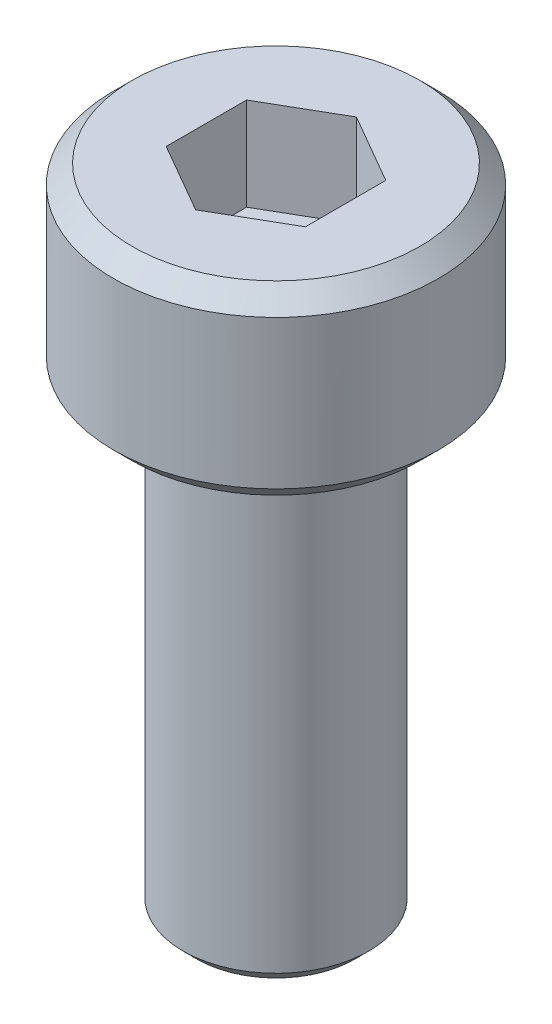
ISO-10303-21;
HEADER;
FILE_DESCRIPTION(('STEP AP214'),'2;1');
FILE_NAME('part.step','',(''),(''),'','','');
FILE_SCHEMA(('AUTOMOTIVE_DESIGN { 1 0 10303 214 1 1 1 1 }'));
ENDSEC;
DATA;
#1=APPLICATION_CONTEXT('core data for automotive mechanical design processes');
#2=APPLICATION_PROTOCOL_DEFINITION('international standard','automotive_design',2000,#1);
#3=PRODUCT_CONTEXT('',#1,'mechanical');
#4=PRODUCT('Part','Part','',(#3));
#5=PRODUCT_RELATED_PRODUCT_CATEGORY('part','',(#4));
#6=PRODUCT_DEFINITION_FORMATION('','',#4);
#7=PRODUCT_DEFINITION_CONTEXT('part definition',#1,'design');
#8=PRODUCT_DEFINITION('design','',#6,#7);
#9=PRODUCT_DEFINITION_SHAPE('','',#8);
#10=(LENGTH_UNIT() NAMED_UNIT(*) SI_UNIT(.MILLI.,.METRE.));
#11=(NAMED_UNIT(*) PLANE_ANGLE_UNIT() SI_UNIT($,.RADIAN.));
#12=(NAMED_UNIT(*) SI_UNIT($,.STERADIAN.) SOLID_ANGLE_UNIT());
#13=UNCERTAINTY_MEASURE_WITH_UNIT(LENGTH_MEASURE(1.E-05),#10,'distance_accuracy_value','');
#14=(GEOMETRIC_REPRESENTATION_CONTEXT(3) GLOBAL_UNCERTAINTY_ASSIGNED_CONTEXT((#13)) GLOBAL_UNIT_ASSIGNED_CONTEXT((#10,
#11,#12)) REPRESENTATION_CONTEXT('',''));
#15=CARTESIAN_POINT('',(0.,0.,0.));
#16=DIRECTION('',(0.,0.,1.));
#17=DIRECTION('',(1.,0.,0.));
#18=AXIS2_PLACEMENT_3D('',#15,#16,#17);
#19=CARTESIAN_POINT('',(0.,2.,-1.73205080756888));
#20=DIRECTION('',(-0.500000000000001,0.,-0.866025403784438));
#21=DIRECTION('',(-0.866025403784438,0.,0.500000000000001));
#22=AXIS2_PLACEMENT_3D('',#19,#20,#21);
#23=PLANE('',#22);
#24=DIRECTION('',(0.,1.,0.));
#25=VECTOR('',#24,1.);
#26=CARTESIAN_POINT('',(-1.5,2.,-0.866025403784438));
#27=LINE('',#26,#25);
#28=CARTESIAN_POINT('',(-1.5,4.,-0.866025403784437));
#29=VERTEX_POINT('',#28);
#30=CARTESIAN_POINT('',(-1.5,2.,-0.866025403784437));
#31=VERTEX_POINT('',#30);
#32=EDGE_CURVE('E82',#29,#31,#27,.F.);
#33=ORIENTED_EDGE('',*,*,#32,.T.);
#34=DIRECTION('',(-0.866025403784438,0.,0.500000000000001));
#35=VECTOR('',#34,1.);
#36=CARTESIAN_POINT('',(0.,2.,-1.73205080756888));
#37=LINE('',#36,#35);
#38=CARTESIAN_POINT('',(0.,2.,-1.73205080756888));
#39=VERTEX_POINT('',#38);
#40=EDGE_CURVE('E71',#39,#31,#37,.T.);
#41=ORIENTED_EDGE('',*,*,#40,.F.);
#42=DIRECTION('',(0.,1.,0.));
#43=VECTOR('',#42,1.);
#44=CARTESIAN_POINT('',(0.,2.,-1.73205080756888));
#45=LINE('',#44,#43);
#46=CARTESIAN_POINT('',(0.,4.,-1.73205080756888));
#47=VERTEX_POINT('',#46);
#48=EDGE_CURVE('E91',#39,#47,#45,.T.);
#49=ORIENTED_EDGE('',*,*,#48,.T.);
#50=DIRECTION('',(-0.866025403784438,0.,0.500000000000001));
#51=VECTOR('',#50,1.);
#52=CARTESIAN_POINT('',(0.,4.,-1.73205080756888));
#53=LINE('',#52,#51);
#54=EDGE_CURVE('E66',#29,#47,#53,.F.);
#55=ORIENTED_EDGE('',*,*,#54,.F.);
#56=EDGE_LOOP('',(#33,#41,#49,#55));
#57=FACE_BOUND('',#56,.T.);
#58=ADVANCED_FACE('F16',(#57),#23,.F.);
#59=CARTESIAN_POINT('',(-1.5,2.,-0.866025403784438));
#60=DIRECTION('',(-1.,0.,0.));
#61=DIRECTION('',(0.,0.,1.));
#62=AXIS2_PLACEMENT_3D('',#59,#60,#61);
#63=PLANE('',#62);
#64=DIRECTION('',(0.,1.,0.));
#65=VECTOR('',#64,1.);
#66=CARTESIAN_POINT('',(-1.5,2.,0.866025403784439));
#67=LINE('',#66,#65);
#68=CARTESIAN_POINT('',(-1.5,4.,0.866025403784439));
#69=VERTEX_POINT('',#68);
#70=CARTESIAN_POINT('',(-1.5,2.,0.866025403784439));
#71=VERTEX_POINT('',#70);
#72=EDGE_CURVE('E87',#69,#71,#67,.F.);
#73=ORIENTED_EDGE('',*,*,#72,.T.);
#74=DIRECTION('',(0.,0.,1.));
#75=VECTOR('',#74,1.);
#76=CARTESIAN_POINT('',(-1.5,2.,-0.866025403784438));
#77=LINE('',#76,#75);
#78=EDGE_CURVE('E75',#31,#71,#77,.T.);
#79=ORIENTED_EDGE('',*,*,#78,.F.);
#80=ORIENTED_EDGE('',*,*,#32,.F.);
#81=DIRECTION('',(0.,0.,1.));
#82=VECTOR('',#81,1.);
#83=CARTESIAN_POINT('',(-1.5,4.,-0.866025403784438));
#84=LINE('',#83,#82);
#85=EDGE_CURVE('E89',#69,#29,#84,.F.);
#86=ORIENTED_EDGE('',*,*,#85,.F.);
#87=EDGE_LOOP('',(#73,#79,#80,#86));
#88=FACE_BOUND('',#87,.T.);
#89=ADVANCED_FACE('F85',(#88),#63,.F.);
#90=CARTESIAN_POINT('',(1.5,2.,-0.866025403784438));
#91=DIRECTION('',(0.5,0.,-0.866025403784439));
#92=DIRECTION('',(-0.866025403784439,0.,-0.5));
#93=AXIS2_PLACEMENT_3D('',#90,#91,#92);
#94=PLANE('',#93);
#95=ORIENTED_EDGE('',*,*,#48,.F.);
#96=DIRECTION('',(-0.866025403784439,0.,-0.5));
#97=VECTOR('',#96,1.);
#98=CARTESIAN_POINT('',(1.5,2.,-0.866025403784438));
#99=LINE('',#98,#97);
#100=CARTESIAN_POINT('',(1.5,2.,-0.866025403784438));
#101=VERTEX_POINT('',#100);
#102=EDGE_CURVE('E78',#101,#39,#99,.T.);
#103=ORIENTED_EDGE('',*,*,#102,.F.);
#104=DIRECTION('',(0.,1.,0.));
#105=VECTOR('',#104,1.);
#106=CARTESIAN_POINT('',(1.5,2.,-0.866025403784438));
#107=LINE('',#106,#105);
#108=CARTESIAN_POINT('',(1.5,4.,-0.866025403784438));
#109=VERTEX_POINT('',#108);
#110=EDGE_CURVE('E121',#101,#109,#107,.T.);
#111=ORIENTED_EDGE('',*,*,#110,.T.);
#112=DIRECTION('',(-0.866025403784439,0.,-0.5));
#113=VECTOR('',#112,1.);
#114=CARTESIAN_POINT('',(1.5,4.,-0.866025403784438));
#115=LINE('',#114,#113);
#116=EDGE_CURVE('E133',#47,#109,#115,.F.);
#117=ORIENTED_EDGE('',*,*,#116,.F.);
#118=EDGE_LOOP('',(#95,#103,#111,#117));
#119=FACE_BOUND('',#118,.T.);
#120=ADVANCED_FACE('F136',(#119),#94,.F.);
#121=CARTESIAN_POINT('',(-1.5,2.,0.866025403784439));
#122=DIRECTION('',(-0.499999999999999,0.,0.866025403784439));
#123=DIRECTION('',(0.866025403784439,0.,0.499999999999999));
#124=AXIS2_PLACEMENT_3D('',#121,#122,#123);
#125=PLANE('',#124);
#126=DIRECTION('',(0.,1.,0.));
#127=VECTOR('',#126,1.);
#128=CARTESIAN_POINT('',(0.,2.,1.73205080756888));
#129=LINE('',#128,#127);
#130=CARTESIAN_POINT('',(0.,4.,1.73205080756888));
#131=VERTEX_POINT('',#130);
#132=CARTESIAN_POINT('',(0.,2.,1.73205080756888));
#133=VERTEX_POINT('',#132);
#134=EDGE_CURVE('E118',#131,#133,#129,.F.);
#135=ORIENTED_EDGE('',*,*,#134,.T.);
#136=DIRECTION('',(0.866025403784439,0.,0.499999999999999));
#137=VECTOR('',#136,1.);
#138=CARTESIAN_POINT('',(-1.5,2.,0.866025403784439));
#139=LINE('',#138,#137);
#140=EDGE_CURVE('E127',#71,#133,#139,.T.);
#141=ORIENTED_EDGE('',*,*,#140,.F.);
#142=ORIENTED_EDGE('',*,*,#72,.F.);
#143=DIRECTION('',(0.866025403784439,0.,0.499999999999999));
#144=VECTOR('',#143,1.);
#145=CARTESIAN_POINT('',(-1.5,4.,0.866025403784439));
#146=LINE('',#145,#144);
#147=EDGE_CURVE('E129',#131,#69,#146,.F.);
#148=ORIENTED_EDGE('',*,*,#147,.F.);
#149=EDGE_LOOP('',(#135,#141,#142,#148));
#150=FACE_BOUND('',#149,.T.);
#151=ADVANCED_FACE('F143',(#150),#125,.F.);
#152=CARTESIAN_POINT('',(1.5,2.,2.59807621135331));
#153=DIRECTION('',(0.,1.,0.));
#154=DIRECTION('',(0.,0.,1.));
#155=AXIS2_PLACEMENT_3D('',#152,#153,#154);
#156=PLANE('',#155);
#157=ORIENTED_EDGE('',*,*,#40,.T.);
#158=ORIENTED_EDGE('',*,*,#78,.T.);
#159=ORIENTED_EDGE('',*,*,#140,.T.);
#160=DIRECTION('',(0.866025403784438,0.,-0.5));
#161=VECTOR('',#160,1.);
#162=CARTESIAN_POINT('',(0.,2.,1.73205080756888));
#163=LINE('',#162,#161);
#164=CARTESIAN_POINT('',(1.5,2.,0.866025403784438));
#165=VERTEX_POINT('',#164);
#166=EDGE_CURVE('E116',#133,#165,#163,.T.);
#167=ORIENTED_EDGE('',*,*,#166,.T.);
#168=DIRECTION('',(0.,0.,-1.));
#169=VECTOR('',#168,1.);
#170=CARTESIAN_POINT('',(1.5,2.,0.866025403784438));
#171=LINE('',#170,#169);
#172=EDGE_CURVE('E124',#165,#101,#171,.T.);
#173=ORIENTED_EDGE('',*,*,#172,.T.);
#174=ORIENTED_EDGE('',*,*,#102,.T.);
#175=EDGE_LOOP('',(#157,#158,#159,#167,#173,#174));
#176=FACE_BOUND('',#175,.T.);
#177=ADVANCED_FACE('F72',(#176),#156,.T.);
#178=CARTESIAN_POINT('',(1.5,2.,0.866025403784438));
#179=DIRECTION('',(1.,0.,0.));
#180=DIRECTION('',(0.,0.,-1.));
#181=AXIS2_PLACEMENT_3D('',#178,#179,#180);
#182=PLANE('',#181);
#183=ORIENTED_EDGE('',*,*,#110,.F.);
#184=ORIENTED_EDGE('',*,*,#172,.F.);
#185=DIRECTION('',(0.,1.,0.));
#186=VECTOR('',#185,1.);
#187=CARTESIAN_POINT('',(1.5,2.,0.866025403784437));
#188=LINE('',#187,#186);
#189=CARTESIAN_POINT('',(1.5,4.,0.866025403784438));
#190=VERTEX_POINT('',#189);
#191=EDGE_CURVE('E114',#165,#190,#188,.T.);
#192=ORIENTED_EDGE('',*,*,#191,.T.);
#193=DIRECTION('',(0.,0.,-1.));
#194=VECTOR('',#193,1.);
#195=CARTESIAN_POINT('',(1.5,4.,0.866025403784438));
#196=LINE('',#195,#194);
#197=EDGE_CURVE('E34',#109,#190,#196,.F.);
#198=ORIENTED_EDGE('',*,*,#197,.F.);
#199=EDGE_LOOP('',(#183,#184,#192,#198));
#200=FACE_BOUND('',#199,.T.);
#201=ADVANCED_FACE('F150',(#200),#182,.F.);
#202=CARTESIAN_POINT('',(0.,2.,1.73205080756888));
#203=DIRECTION('',(0.5,0.,0.866025403784438));
#204=DIRECTION('',(0.866025403784438,0.,-0.5));
#205=AXIS2_PLACEMENT_3D('',#202,#203,#204);
#206=PLANE('',#205);
#207=ORIENTED_EDGE('',*,*,#191,.F.);
#208=ORIENTED_EDGE('',*,*,#166,.F.);
#209=ORIENTED_EDGE('',*,*,#134,.F.);
#210=DIRECTION('',(-0.866025403784438,0.,0.5));
#211=VECTOR('',#210,1.);
#212=CARTESIAN_POINT('',(1.5,4.,0.866025403784438));
#213=LINE('',#212,#211);
#214=EDGE_CURVE('E112',#190,#131,#213,.T.);
#215=ORIENTED_EDGE('',*,*,#214,.F.);
#216=EDGE_LOOP('',(#207,#208,#209,#215));
#217=FACE_BOUND('',#216,.T.);
#218=ADVANCED_FACE('F148',(#217),#206,.F.);
#219=CARTESIAN_POINT('',(0.,4.,0.));
#220=DIRECTION('',(0.,1.,0.));
#221=DIRECTION('',(0.,0.,1.));
#222=AXIS2_PLACEMENT_3D('',#219,#220,#221);
#223=PLANE('',#222);
#224=ORIENTED_EDGE('',*,*,#197,.T.);
#225=ORIENTED_EDGE('',*,*,#214,.T.);
#226=ORIENTED_EDGE('',*,*,#147,.T.);
#227=ORIENTED_EDGE('',*,*,#85,.T.);
#228=ORIENTED_EDGE('',*,*,#54,.T.);
#229=ORIENTED_EDGE('',*,*,#116,.T.);
#230=EDGE_LOOP('',(#224,#225,#226,#227,#228,#229));
#231=FACE_BOUND('',#230,.T.);
#232=CARTESIAN_POINT('',(0.,4.0000000000191,0.));
#233=DIRECTION('',(0.,-1.,0.));
#234=DIRECTION('',(0.,0.,-1.));
#235=AXIS2_PLACEMENT_3D('',#232,#233,#234);
#236=CIRCLE('',#235,3.10000000001764);
#237=CARTESIAN_POINT('',(0.,4.0000000000191,-3.10000000001764));
#238=VERTEX_POINT('',#237);
#239=EDGE_CURVE('E19',#238,#238,#236,.T.);
#240=ORIENTED_EDGE('',*,*,#239,.F.);
#241=EDGE_LOOP('',(#240));
#242=FACE_BOUND('',#241,.T.);
#243=ADVANCED_FACE('F138',(#231,#242),#223,.T.);
#244=CARTESIAN_POINT('',(0.,3.60000000000582,0.));
#245=DIRECTION('',(0.,-1.,0.));
#246=DIRECTION('',(0.,0.,-1.));
#247=AXIS2_PLACEMENT_3D('',#244,#245,#246);
#248=CONICAL_SURFACE('',#247,3.50000000003092,0.785398163397448);
#249=ORIENTED_EDGE('',*,*,#239,.T.);
#250=EDGE_LOOP('',(#249));
#251=FACE_BOUND('',#250,.T.);
#252=CARTESIAN_POINT('',(0.,3.6,0.));
#253=DIRECTION('',(0.,-1.,0.));
#254=DIRECTION('',(0.,0.,-1.));
#255=AXIS2_PLACEMENT_3D('',#252,#253,#254);
#256=CIRCLE('',#255,3.5);
#257=CARTESIAN_POINT('',(0.,3.6,-3.5));
#258=VERTEX_POINT('',#257);
#259=EDGE_CURVE('E104',#258,#258,#256,.T.);
#260=ORIENTED_EDGE('',*,*,#259,.F.);
#261=EDGE_LOOP('',(#260));
#262=FACE_BOUND('',#261,.T.);
#263=ADVANCED_FACE('F187',(#251,#262),#248,.T.);
#264=CARTESIAN_POINT('',(0.,4.,0.));
#265=DIRECTION('',(0.,-1.,0.));
#266=DIRECTION('',(0.,0.,-1.));
#267=AXIS2_PLACEMENT_3D('',#264,#265,#266);
#268=CYLINDRICAL_SURFACE('',#267,3.5);
#269=ORIENTED_EDGE('',*,*,#259,.T.);
#270=EDGE_LOOP('',(#269));
#271=FACE_BOUND('',#270,.T.);
#272=CARTESIAN_POINT('',(0.,0.400000000013279,0.));
#273=DIRECTION('',(0.,1.,0.));
#274=DIRECTION('',(0.,0.,1.));
#275=AXIS2_PLACEMENT_3D('',#272,#273,#274);
#276=CIRCLE('',#275,3.50000000003092);
#277=CARTESIAN_POINT('',(0.,0.400000000013279,3.50000000003092));
#278=VERTEX_POINT('',#277);
#279=EDGE_CURVE('E100',#278,#278,#276,.F.);
#280=ORIENTED_EDGE('',*,*,#279,.F.);
#281=EDGE_LOOP('',(#280));
#282=FACE_BOUND('',#281,.T.);
#283=ADVANCED_FACE('F183',(#271,#282),#268,.T.);
#284=CARTESIAN_POINT('',(0.,-10.,0.));
#285=DIRECTION('',(0.,1.,0.));
#286=DIRECTION('',(0.,0.,1.));
#287=AXIS2_PLACEMENT_3D('',#284,#285,#286);
#288=PLANE('',#287);
#289=CARTESIAN_POINT('',(0.,-9.99999999999091,0.));
#290=DIRECTION('',(0.,1.,0.));
#291=DIRECTION('',(0.,0.,1.));
#292=AXIS2_PLACEMENT_3D('',#289,#290,#291);
#293=CIRCLE('',#292,1.70000000008486);
#294=CARTESIAN_POINT('',(0.,-9.99999999999091,1.70000000008486));
#295=VERTEX_POINT('',#294);
#296=EDGE_CURVE('E98',#295,#295,#293,.T.);
#297=ORIENTED_EDGE('',*,*,#296,.F.);
#298=EDGE_LOOP('',(#297));
#299=FACE_BOUND('',#298,.T.);
#300=ADVANCED_FACE('F179',(#299),#288,.F.);
#301=CARTESIAN_POINT('',(0.,0.399999999956435,0.));
#302=DIRECTION('',(0.,1.,0.));
#303=DIRECTION('',(0.,0.,1.));
#304=AXIS2_PLACEMENT_3D('',#301,#302,#303);
#305=CONICAL_SURFACE('',#304,3.49999999991724,0.785398163326394);
#306=CARTESIAN_POINT('',(0.,5.6843418860808E-11,0.));
#307=DIRECTION('',(0.,1.,0.));
#308=DIRECTION('',(0.,0.,1.));
#309=AXIS2_PLACEMENT_3D('',#306,#307,#308);
#310=CIRCLE('',#309,3.10000000007449);
#311=CARTESIAN_POINT('',(0.,5.6843418860808E-11,3.10000000007449));
#312=VERTEX_POINT('',#311);
#313=EDGE_CURVE('E96',#312,#312,#310,.T.);
#314=ORIENTED_EDGE('',*,*,#313,.T.);
#315=EDGE_LOOP('',(#314));
#316=FACE_BOUND('',#315,.T.);
#317=ORIENTED_EDGE('',*,*,#279,.T.);
#318=EDGE_LOOP('',(#317));
#319=FACE_BOUND('',#318,.T.);
#320=ADVANCED_FACE('F175',(#316,#319),#305,.T.);
#321=CARTESIAN_POINT('',(0.,-9.70000000012305,0.));
#322=DIRECTION('',(0.,1.,0.));
#323=DIRECTION('',(0.,0.,1.));
#324=AXIS2_PLACEMENT_3D('',#321,#322,#323);
#325=CONICAL_SURFACE('',#324,1.99999999995271,0.785398163397448);
#326=CARTESIAN_POINT('',(0.,-9.7,0.));
#327=DIRECTION('',(0.,1.,0.));
#328=DIRECTION('',(0.,0.,1.));
#329=AXIS2_PLACEMENT_3D('',#326,#327,#328);
#330=CIRCLE('',#329,2.);
#331=CARTESIAN_POINT('',(0.,-9.7,2.));
#332=VERTEX_POINT('',#331);
#333=EDGE_CURVE('E25',#332,#332,#330,.T.);
#334=ORIENTED_EDGE('',*,*,#333,.F.);
#335=EDGE_LOOP('',(#334));
#336=FACE_BOUND('',#335,.T.);
#337=ORIENTED_EDGE('',*,*,#296,.T.);
#338=EDGE_LOOP('',(#337));
#339=FACE_BOUND('',#338,.T.);
#340=ADVANCED_FACE('F168',(#336,#339),#325,.T.);
#341=CARTESIAN_POINT('',(0.,0.,0.));
#342=DIRECTION('',(0.,1.,0.));
#343=DIRECTION('',(0.,0.,1.));
#344=AXIS2_PLACEMENT_3D('',#341,#342,#343);
#345=PLANE('',#344);
#346=CARTESIAN_POINT('',(0.,0.,0.));
#347=DIRECTION('',(0.,1.,0.));
#348=DIRECTION('',(0.,0.,1.));
#349=AXIS2_PLACEMENT_3D('',#346,#347,#348);
#350=CIRCLE('',#349,2.);
#351=CARTESIAN_POINT('',(0.,0.,2.));
#352=VERTEX_POINT('',#351);
#353=EDGE_CURVE('E11',#352,#352,#350,.F.);
#354=ORIENTED_EDGE('',*,*,#353,.F.);
#355=EDGE_LOOP('',(#354));
#356=FACE_BOUND('',#355,.T.);
#357=ORIENTED_EDGE('',*,*,#313,.F.);
#358=EDGE_LOOP('',(#357));
#359=FACE_BOUND('',#358,.T.);
#360=ADVANCED_FACE('F162',(#356,#359),#345,.F.);
#361=CARTESIAN_POINT('',(0.,-10.,0.));
#362=DIRECTION('',(0.,1.,0.));
#363=DIRECTION('',(0.,0.,1.));
#364=AXIS2_PLACEMENT_3D('',#361,#362,#363);
#365=CYLINDRICAL_SURFACE('',#364,2.);
#366=ORIENTED_EDGE('',*,*,#353,.T.);
#367=EDGE_LOOP('',(#366));
#368=FACE_BOUND('',#367,.T.);
#369=ORIENTED_EDGE('',*,*,#333,.T.);
#370=EDGE_LOOP('',(#369));
#371=FACE_BOUND('',#370,.T.);
#372=ADVANCED_FACE('F160',(#368,#371),#365,.T.);
#373=CLOSED_SHELL('',(#58,#89,#120,#151,#177,#201,#218,#243,#263,#283,#300,#320,#340,#360,#372));
#374=MANIFOLD_SOLID_BREP('B1',#373);
#375=ADVANCED_BREP_SHAPE_REPRESENTATION('',(#18,#374),#14);
#376=SHAPE_DEFINITION_REPRESENTATION(#9,#375);
ENDSEC;
END-ISO-10303-21;
